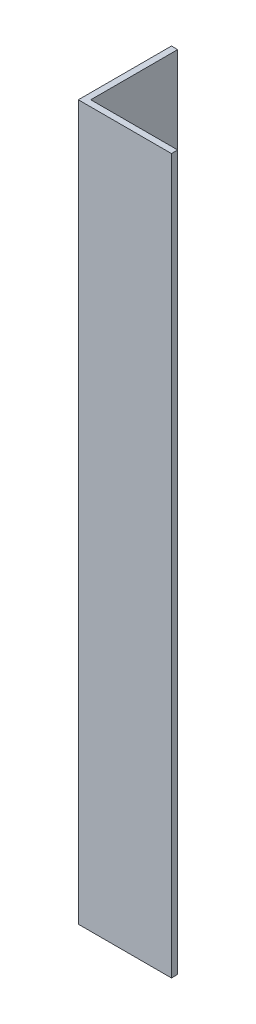
ISO-10303-21;
HEADER;
FILE_DESCRIPTION(('STEP AP214'),'2;1');
FILE_NAME('part.step','',(''),(''),'','','');
FILE_SCHEMA(('AUTOMOTIVE_DESIGN { 1 0 10303 214 1 1 1 1 }'));
ENDSEC;
DATA;
#1=APPLICATION_CONTEXT('core data for automotive mechanical design processes');
#2=APPLICATION_PROTOCOL_DEFINITION('international standard','automotive_design',2000,#1);
#3=PRODUCT_CONTEXT('',#1,'mechanical');
#4=PRODUCT('Part','Part','',(#3));
#5=PRODUCT_RELATED_PRODUCT_CATEGORY('part','',(#4));
#6=PRODUCT_DEFINITION_FORMATION('','',#4);
#7=PRODUCT_DEFINITION_CONTEXT('part definition',#1,'design');
#8=PRODUCT_DEFINITION('design','',#6,#7);
#9=PRODUCT_DEFINITION_SHAPE('','',#8);
#10=(LENGTH_UNIT() NAMED_UNIT(*) SI_UNIT(.MILLI.,.METRE.));
#11=(NAMED_UNIT(*) PLANE_ANGLE_UNIT() SI_UNIT($,.RADIAN.));
#12=(NAMED_UNIT(*) SI_UNIT($,.STERADIAN.) SOLID_ANGLE_UNIT());
#13=UNCERTAINTY_MEASURE_WITH_UNIT(LENGTH_MEASURE(1.E-05),#10,'distance_accuracy_value','');
#14=(GEOMETRIC_REPRESENTATION_CONTEXT(3) GLOBAL_UNCERTAINTY_ASSIGNED_CONTEXT((#13)) GLOBAL_UNIT_ASSIGNED_CONTEXT((#10,
#11,#12)) REPRESENTATION_CONTEXT('',''));
#15=CARTESIAN_POINT('',(0.,0.,0.));
#16=DIRECTION('',(0.,0.,1.));
#17=DIRECTION('',(1.,0.,0.));
#18=AXIS2_PLACEMENT_3D('',#15,#16,#17);
#19=CARTESIAN_POINT('',(15.,115.,0.));
#20=DIRECTION('',(0.,0.,-1.));
#21=DIRECTION('',(-1.,0.,0.));
#22=AXIS2_PLACEMENT_3D('',#19,#20,#21);
#23=PLANE('',#22);
#24=DIRECTION('',(1.,0.,0.));
#25=VECTOR('',#24,1.);
#26=CARTESIAN_POINT('',(15.,0.,0.));
#27=LINE('',#26,#25);
#28=CARTESIAN_POINT('',(0.,0.,0.));
#29=VERTEX_POINT('',#28);
#30=CARTESIAN_POINT('',(15.,0.,0.));
#31=VERTEX_POINT('',#30);
#32=EDGE_CURVE('E121',#29,#31,#27,.T.);
#33=ORIENTED_EDGE('',*,*,#32,.T.);
#34=DIRECTION('',(0.,-1.,0.));
#35=VECTOR('',#34,1.);
#36=CARTESIAN_POINT('',(15.,115.,0.));
#37=LINE('',#36,#35);
#38=CARTESIAN_POINT('',(15.,115.,0.));
#39=VERTEX_POINT('',#38);
#40=EDGE_CURVE('E11',#39,#31,#37,.T.);
#41=ORIENTED_EDGE('',*,*,#40,.F.);
#42=DIRECTION('',(1.,0.,0.));
#43=VECTOR('',#42,1.);
#44=CARTESIAN_POINT('',(15.,115.,0.));
#45=LINE('',#44,#43);
#46=CARTESIAN_POINT('',(0.,115.,0.));
#47=VERTEX_POINT('',#46);
#48=EDGE_CURVE('E131',#47,#39,#45,.T.);
#49=ORIENTED_EDGE('',*,*,#48,.F.);
#50=DIRECTION('',(0.,-1.,0.));
#51=VECTOR('',#50,1.);
#52=CARTESIAN_POINT('',(0.,115.,0.));
#53=LINE('',#52,#51);
#54=EDGE_CURVE('E117',#47,#29,#53,.T.);
#55=ORIENTED_EDGE('',*,*,#54,.T.);
#56=EDGE_LOOP('',(#33,#41,#49,#55));
#57=FACE_BOUND('',#56,.T.);
#58=ADVANCED_FACE('F37',(#57),#23,.F.);
#59=CARTESIAN_POINT('',(15.,115.,-0.999999999999998));
#60=DIRECTION('',(-1.,0.,0.));
#61=DIRECTION('',(0.,0.,1.));
#62=AXIS2_PLACEMENT_3D('',#59,#60,#61);
#63=PLANE('',#62);
#64=DIRECTION('',(0.,0.,-1.));
#65=VECTOR('',#64,1.);
#66=CARTESIAN_POINT('',(15.,0.,-0.999999999999998));
#67=LINE('',#66,#65);
#68=CARTESIAN_POINT('',(15.,0.,-0.999999999999998));
#69=VERTEX_POINT('',#68);
#70=EDGE_CURVE('E124',#31,#69,#67,.T.);
#71=ORIENTED_EDGE('',*,*,#70,.T.);
#72=DIRECTION('',(0.,-1.,0.));
#73=VECTOR('',#72,1.);
#74=CARTESIAN_POINT('',(15.,115.,-0.999999999999998));
#75=LINE('',#74,#73);
#76=CARTESIAN_POINT('',(15.,115.,-0.999999999999998));
#77=VERTEX_POINT('',#76);
#78=EDGE_CURVE('E45',#77,#69,#75,.T.);
#79=ORIENTED_EDGE('',*,*,#78,.F.);
#80=DIRECTION('',(0.,0.,-1.));
#81=VECTOR('',#80,1.);
#82=CARTESIAN_POINT('',(15.,115.,-0.999999999999998));
#83=LINE('',#82,#81);
#84=EDGE_CURVE('E90',#39,#77,#83,.T.);
#85=ORIENTED_EDGE('',*,*,#84,.F.);
#86=ORIENTED_EDGE('',*,*,#40,.T.);
#87=EDGE_LOOP('',(#71,#79,#85,#86));
#88=FACE_BOUND('',#87,.T.);
#89=ADVANCED_FACE('F155',(#88),#63,.F.);
#90=CARTESIAN_POINT('',(1.,115.,-0.999999999999997));
#91=DIRECTION('',(0.,0.,1.));
#92=DIRECTION('',(1.,0.,0.));
#93=AXIS2_PLACEMENT_3D('',#90,#91,#92);
#94=PLANE('',#93);
#95=DIRECTION('',(-1.,0.,0.));
#96=VECTOR('',#95,1.);
#97=CARTESIAN_POINT('',(1.,0.,-0.999999999999997));
#98=LINE('',#97,#96);
#99=CARTESIAN_POINT('',(1.,0.,-0.999999999999997));
#100=VERTEX_POINT('',#99);
#101=EDGE_CURVE('E126',#69,#100,#98,.T.);
#102=ORIENTED_EDGE('',*,*,#101,.T.);
#103=DIRECTION('',(0.,-1.,0.));
#104=VECTOR('',#103,1.);
#105=CARTESIAN_POINT('',(1.,115.,-0.999999999999997));
#106=LINE('',#105,#104);
#107=CARTESIAN_POINT('',(1.,115.,-0.999999999999997));
#108=VERTEX_POINT('',#107);
#109=EDGE_CURVE('E112',#108,#100,#106,.T.);
#110=ORIENTED_EDGE('',*,*,#109,.F.);
#111=DIRECTION('',(-1.,0.,0.));
#112=VECTOR('',#111,1.);
#113=CARTESIAN_POINT('',(1.,115.,-0.999999999999997));
#114=LINE('',#113,#112);
#115=EDGE_CURVE('E103',#77,#108,#114,.T.);
#116=ORIENTED_EDGE('',*,*,#115,.F.);
#117=ORIENTED_EDGE('',*,*,#78,.T.);
#118=EDGE_LOOP('',(#102,#110,#116,#117));
#119=FACE_BOUND('',#118,.T.);
#120=ADVANCED_FACE('F137',(#119),#94,.F.);
#121=CARTESIAN_POINT('',(0.999999999999998,115.,-15.));
#122=DIRECTION('',(-1.,0.,0.));
#123=DIRECTION('',(0.,0.,1.));
#124=AXIS2_PLACEMENT_3D('',#121,#122,#123);
#125=PLANE('',#124);
#126=DIRECTION('',(0.,0.,-1.));
#127=VECTOR('',#126,1.);
#128=CARTESIAN_POINT('',(0.999999999999998,0.,-15.));
#129=LINE('',#128,#127);
#130=CARTESIAN_POINT('',(0.999999999999998,0.,-15.));
#131=VERTEX_POINT('',#130);
#132=EDGE_CURVE('E111',#100,#131,#129,.T.);
#133=ORIENTED_EDGE('',*,*,#132,.T.);
#134=DIRECTION('',(0.,-1.,0.));
#135=VECTOR('',#134,1.);
#136=CARTESIAN_POINT('',(0.999999999999998,115.,-15.));
#137=LINE('',#136,#135);
#138=CARTESIAN_POINT('',(0.999999999999998,115.,-15.));
#139=VERTEX_POINT('',#138);
#140=EDGE_CURVE('E108',#139,#131,#137,.T.);
#141=ORIENTED_EDGE('',*,*,#140,.F.);
#142=DIRECTION('',(0.,0.,-1.));
#143=VECTOR('',#142,1.);
#144=CARTESIAN_POINT('',(0.999999999999998,115.,-15.));
#145=LINE('',#144,#143);
#146=EDGE_CURVE('E97',#108,#139,#145,.T.);
#147=ORIENTED_EDGE('',*,*,#146,.F.);
#148=ORIENTED_EDGE('',*,*,#109,.T.);
#149=EDGE_LOOP('',(#133,#141,#147,#148));
#150=FACE_BOUND('',#149,.T.);
#151=ADVANCED_FACE('F109',(#150),#125,.F.);
#152=CARTESIAN_POINT('',(0.,115.,-15.));
#153=DIRECTION('',(0.,0.,1.));
#154=DIRECTION('',(1.,0.,0.));
#155=AXIS2_PLACEMENT_3D('',#152,#153,#154);
#156=PLANE('',#155);
#157=DIRECTION('',(-1.,0.,0.));
#158=VECTOR('',#157,1.);
#159=CARTESIAN_POINT('',(0.,0.,-15.));
#160=LINE('',#159,#158);
#161=CARTESIAN_POINT('',(0.,0.,-15.));
#162=VERTEX_POINT('',#161);
#163=EDGE_CURVE('E76',#131,#162,#160,.T.);
#164=ORIENTED_EDGE('',*,*,#163,.T.);
#165=DIRECTION('',(0.,-1.,0.));
#166=VECTOR('',#165,1.);
#167=CARTESIAN_POINT('',(0.,115.,-15.));
#168=LINE('',#167,#166);
#169=CARTESIAN_POINT('',(0.,115.,-15.));
#170=VERTEX_POINT('',#169);
#171=EDGE_CURVE('E113',#170,#162,#168,.T.);
#172=ORIENTED_EDGE('',*,*,#171,.F.);
#173=DIRECTION('',(-1.,0.,0.));
#174=VECTOR('',#173,1.);
#175=CARTESIAN_POINT('',(0.,115.,-15.));
#176=LINE('',#175,#174);
#177=EDGE_CURVE('E101',#139,#170,#176,.T.);
#178=ORIENTED_EDGE('',*,*,#177,.F.);
#179=ORIENTED_EDGE('',*,*,#140,.T.);
#180=EDGE_LOOP('',(#164,#172,#178,#179));
#181=FACE_BOUND('',#180,.T.);
#182=ADVANCED_FACE('F115',(#181),#156,.F.);
#183=CARTESIAN_POINT('',(0.,115.,0.));
#184=DIRECTION('',(1.,0.,0.));
#185=DIRECTION('',(0.,0.,-1.));
#186=AXIS2_PLACEMENT_3D('',#183,#184,#185);
#187=PLANE('',#186);
#188=DIRECTION('',(0.,0.,1.));
#189=VECTOR('',#188,1.);
#190=CARTESIAN_POINT('',(0.,0.,0.));
#191=LINE('',#190,#189);
#192=EDGE_CURVE('E82',#162,#29,#191,.T.);
#193=ORIENTED_EDGE('',*,*,#192,.T.);
#194=ORIENTED_EDGE('',*,*,#54,.F.);
#195=DIRECTION('',(0.,0.,1.));
#196=VECTOR('',#195,1.);
#197=CARTESIAN_POINT('',(0.,115.,0.));
#198=LINE('',#197,#196);
#199=EDGE_CURVE('E53',#170,#47,#198,.T.);
#200=ORIENTED_EDGE('',*,*,#199,.F.);
#201=ORIENTED_EDGE('',*,*,#171,.T.);
#202=EDGE_LOOP('',(#193,#194,#200,#201));
#203=FACE_BOUND('',#202,.T.);
#204=ADVANCED_FACE('F144',(#203),#187,.F.);
#205=CARTESIAN_POINT('',(0.,115.,0.));
#206=DIRECTION('',(0.,-1.,0.));
#207=DIRECTION('',(0.,0.,-1.));
#208=AXIS2_PLACEMENT_3D('',#205,#206,#207);
#209=PLANE('',#208);
#210=ORIENTED_EDGE('',*,*,#48,.T.);
#211=ORIENTED_EDGE('',*,*,#84,.T.);
#212=ORIENTED_EDGE('',*,*,#115,.T.);
#213=ORIENTED_EDGE('',*,*,#146,.T.);
#214=ORIENTED_EDGE('',*,*,#177,.T.);
#215=ORIENTED_EDGE('',*,*,#199,.T.);
#216=EDGE_LOOP('',(#210,#211,#212,#213,#214,#215));
#217=FACE_BOUND('',#216,.T.);
#218=ADVANCED_FACE('F99',(#217),#209,.F.);
#219=CARTESIAN_POINT('',(0.,0.,0.));
#220=DIRECTION('',(0.,-1.,0.));
#221=DIRECTION('',(0.,0.,-1.));
#222=AXIS2_PLACEMENT_3D('',#219,#220,#221);
#223=PLANE('',#222);
#224=ORIENTED_EDGE('',*,*,#32,.F.);
#225=ORIENTED_EDGE('',*,*,#192,.F.);
#226=ORIENTED_EDGE('',*,*,#163,.F.);
#227=ORIENTED_EDGE('',*,*,#132,.F.);
#228=ORIENTED_EDGE('',*,*,#101,.F.);
#229=ORIENTED_EDGE('',*,*,#70,.F.);
#230=EDGE_LOOP('',(#224,#225,#226,#227,#228,#229));
#231=FACE_BOUND('',#230,.T.);
#232=ADVANCED_FACE('F140',(#231),#223,.T.);
#233=CLOSED_SHELL('',(#58,#89,#120,#151,#182,#204,#218,#232));
#234=MANIFOLD_SOLID_BREP('B2',#233);
#235=ADVANCED_BREP_SHAPE_REPRESENTATION('',(#18,#234),#14);
#236=SHAPE_DEFINITION_REPRESENTATION(#9,#235);
ENDSEC;
END-ISO-10303-21;
